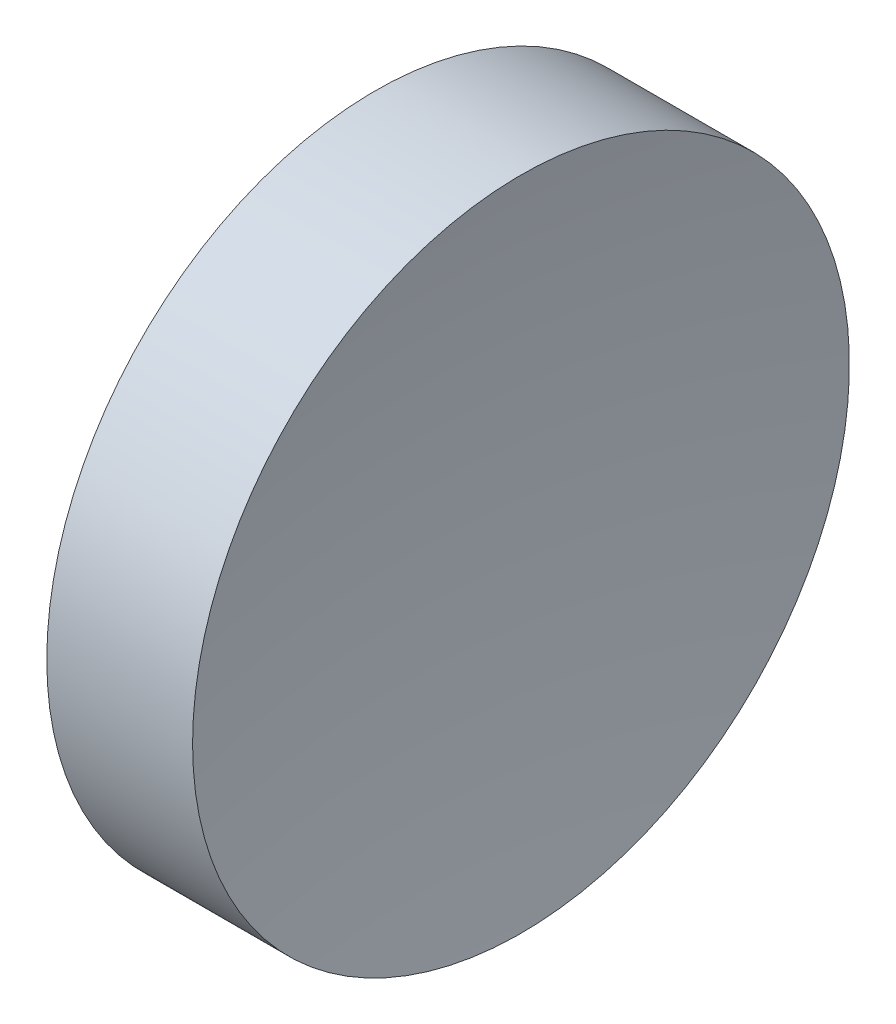
ISO-10303-21;
HEADER;
FILE_DESCRIPTION(('STEP AP214'),'2;1');
FILE_NAME('part.step','',(''),(''),'','','');
FILE_SCHEMA(('AUTOMOTIVE_DESIGN { 1 0 10303 214 1 1 1 1 }'));
ENDSEC;
DATA;
#1=APPLICATION_CONTEXT('core data for automotive mechanical design processes');
#2=APPLICATION_PROTOCOL_DEFINITION('international standard','automotive_design',2000,#1);
#3=PRODUCT_CONTEXT('',#1,'mechanical');
#4=PRODUCT('Part','Part','',(#3));
#5=PRODUCT_RELATED_PRODUCT_CATEGORY('part','',(#4));
#6=PRODUCT_DEFINITION_FORMATION('','',#4);
#7=PRODUCT_DEFINITION_CONTEXT('part definition',#1,'design');
#8=PRODUCT_DEFINITION('design','',#6,#7);
#9=PRODUCT_DEFINITION_SHAPE('','',#8);
#10=(LENGTH_UNIT() NAMED_UNIT(*) SI_UNIT(.MILLI.,.METRE.));
#11=(NAMED_UNIT(*) PLANE_ANGLE_UNIT() SI_UNIT($,.RADIAN.));
#12=(NAMED_UNIT(*) SI_UNIT($,.STERADIAN.) SOLID_ANGLE_UNIT());
#13=UNCERTAINTY_MEASURE_WITH_UNIT(LENGTH_MEASURE(1.E-05),#10,'distance_accuracy_value','');
#14=(GEOMETRIC_REPRESENTATION_CONTEXT(3) GLOBAL_UNCERTAINTY_ASSIGNED_CONTEXT((#13)) GLOBAL_UNIT_ASSIGNED_CONTEXT((#10,
#11,#12)) REPRESENTATION_CONTEXT('',''));
#15=CARTESIAN_POINT('',(0.,0.,0.));
#16=DIRECTION('',(0.,0.,1.));
#17=DIRECTION('',(1.,0.,0.));
#18=AXIS2_PLACEMENT_3D('',#15,#16,#17);
#19=CARTESIAN_POINT('',(389.185308874078,138.756042246745,-6.81296036253443E-06));
#20=DIRECTION('',(0.,-1.,0.));
#21=DIRECTION('',(0.,0.,1.));
#22=AXIS2_PLACEMENT_3D('',#19,#20,#21);
#23=CIRCLE('',#22,150.);
#24=TRIMMED_CURVE('',#23,(PARAMETER_VALUE(-1.57079628137516)),
(PARAMETER_VALUE(1.57079628137516)),.T.,.PARAMETER.);
#25=CARTESIAN_POINT('',(389.185308874078,138.756042246745,0.));
#26=DIRECTION('',(-1.,0.,0.));
#27=AXIS1_PLACEMENT('',#25,#26);
#28=SURFACE_OF_REVOLUTION('',#24,#27);
#29=CARTESIAN_POINT('',(241.283315448189,138.756042246745,0.));
#30=DIRECTION('',(-1.,0.,0.));
#31=DIRECTION('',(0.,0.,1.));
#32=AXIS2_PLACEMENT_3D('',#29,#30,#31);
#33=CIRCLE('',#32,25.);
#34=CARTESIAN_POINT('',(241.283315448189,138.756042246745,25.));
#35=VERTEX_POINT('',#34);
#36=EDGE_CURVE('E11',#35,#35,#33,.T.);
#37=ORIENTED_EDGE('',*,*,#36,.F.);
#38=EDGE_LOOP('',(#37));
#39=FACE_BOUND('',#38,.T.);
#40=CARTESIAN_POINT('',(239.185308874079,138.756042246745,0.));
#41=VERTEX_POINT('',#40);
#42=VERTEX_LOOP('',#41);
#43=FACE_BOUND('',#42,.T.);
#44=ADVANCED_FACE('F37',(#39,#43),#28,.F.);
#45=CARTESIAN_POINT('',(217.97028600433,138.756042246745,0.));
#46=DIRECTION('',(-1.,0.,0.));
#47=DIRECTION('',(0.,0.,1.));
#48=AXIS2_PLACEMENT_3D('',#45,#46,#47);
#49=CYLINDRICAL_SURFACE('',#48,25.);
#50=CARTESIAN_POINT('',(230.185311069839,138.756042246745,0.));
#51=DIRECTION('',(-1.,0.,0.));
#52=DIRECTION('',(0.,0.,1.));
#53=AXIS2_PLACEMENT_3D('',#50,#51,#52);
#54=CIRCLE('',#53,25.);
#55=CARTESIAN_POINT('',(230.185311069839,138.756042246745,25.));
#56=VERTEX_POINT('',#55);
#57=EDGE_CURVE('E43',#56,#56,#54,.T.);
#58=ORIENTED_EDGE('',*,*,#57,.F.);
#59=EDGE_LOOP('',(#58));
#60=FACE_BOUND('',#59,.T.);
#61=ORIENTED_EDGE('',*,*,#36,.T.);
#62=EDGE_LOOP('',(#61));
#63=FACE_BOUND('',#62,.T.);
#64=ADVANCED_FACE('F47',(#60,#63),#49,.T.);
#65=CARTESIAN_POINT('',(230.185311069839,138.756042246745,0.));
#66=DIRECTION('',(1.,0.,0.));
#67=DIRECTION('',(0.,0.,-1.));
#68=AXIS2_PLACEMENT_3D('',#65,#66,#67);
#69=PLANE('',#68);
#70=ORIENTED_EDGE('',*,*,#57,.T.);
#71=EDGE_LOOP('',(#70));
#72=FACE_BOUND('',#71,.T.);
#73=ADVANCED_FACE('F52',(#72),#69,.F.);
#74=CLOSED_SHELL('',(#44,#64,#73));
#75=MANIFOLD_SOLID_BREP('B2',#74);
#76=ADVANCED_BREP_SHAPE_REPRESENTATION('',(#18,#75),#14);
#77=SHAPE_DEFINITION_REPRESENTATION(#9,#76);
ENDSEC;
END-ISO-10303-21;
